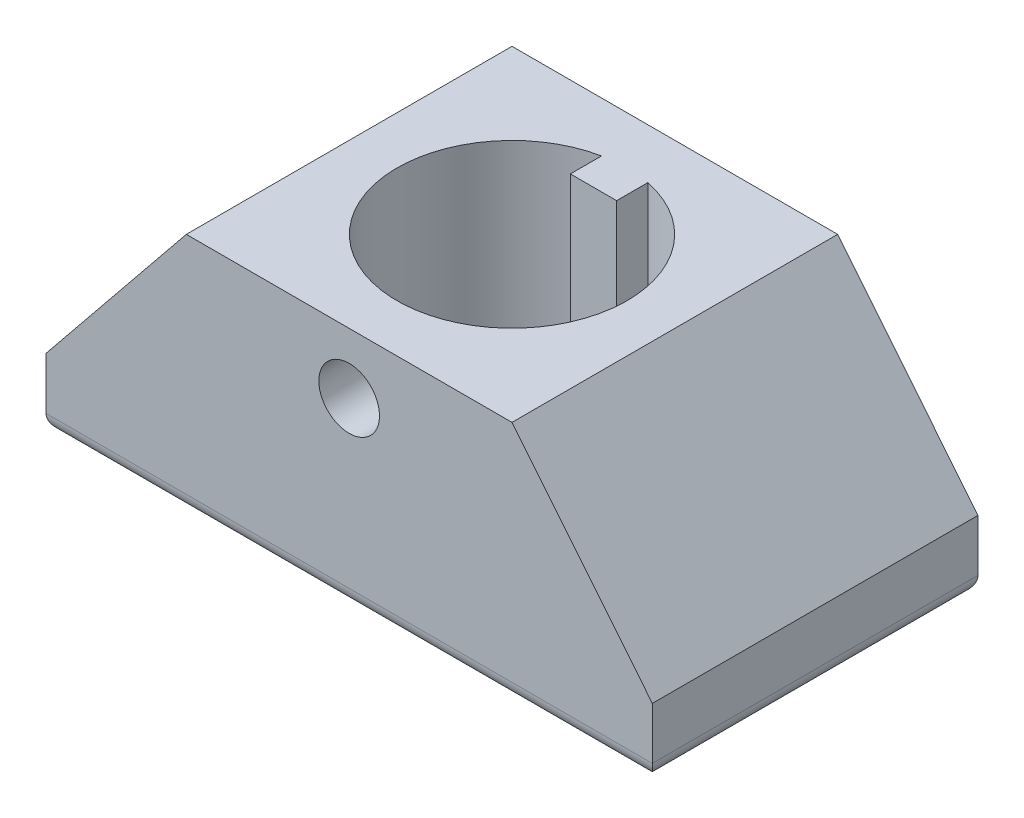
ISO-10303-21;
HEADER;
FILE_DESCRIPTION(('STEP AP214'),'2;1');
FILE_NAME('part.step','',(''),(''),'','','');
FILE_SCHEMA(('AUTOMOTIVE_DESIGN { 1 0 10303 214 1 1 1 1 }'));
ENDSEC;
DATA;
#1=APPLICATION_CONTEXT('core data for automotive mechanical design processes');
#2=APPLICATION_PROTOCOL_DEFINITION('international standard','automotive_design',2000,#1);
#3=PRODUCT_CONTEXT('',#1,'mechanical');
#4=PRODUCT('Part','Part','',(#3));
#5=PRODUCT_RELATED_PRODUCT_CATEGORY('part','',(#4));
#6=PRODUCT_DEFINITION_FORMATION('','',#4);
#7=PRODUCT_DEFINITION_CONTEXT('part definition',#1,'design');
#8=PRODUCT_DEFINITION('design','',#6,#7);
#9=PRODUCT_DEFINITION_SHAPE('','',#8);
#10=(LENGTH_UNIT() NAMED_UNIT(*) SI_UNIT(.MILLI.,.METRE.));
#11=(NAMED_UNIT(*) PLANE_ANGLE_UNIT() SI_UNIT($,.RADIAN.));
#12=(NAMED_UNIT(*) SI_UNIT($,.STERADIAN.) SOLID_ANGLE_UNIT());
#13=UNCERTAINTY_MEASURE_WITH_UNIT(LENGTH_MEASURE(1.E-05),#10,'distance_accuracy_value','');
#14=(GEOMETRIC_REPRESENTATION_CONTEXT(3) GLOBAL_UNCERTAINTY_ASSIGNED_CONTEXT((#13)) GLOBAL_UNIT_ASSIGNED_CONTEXT((#10,
#11,#12)) REPRESENTATION_CONTEXT('',''));
#15=CARTESIAN_POINT('',(0.,0.,0.));
#16=DIRECTION('',(0.,0.,1.));
#17=DIRECTION('',(1.,0.,0.));
#18=AXIS2_PLACEMENT_3D('',#15,#16,#17);
#19=CARTESIAN_POINT('',(-9.4,10.,9.4));
#20=DIRECTION('',(0.,0.,-1.));
#21=DIRECTION('',(-1.,0.,0.));
#22=AXIS2_PLACEMENT_3D('',#19,#20,#21);
#23=PLANE('',#22);
#24=DIRECTION('',(0.,1.,0.));
#25=VECTOR('',#24,1.);
#26=CARTESIAN_POINT('',(-17.5,-4.,9.4));
#27=LINE('',#26,#25);
#28=CARTESIAN_POINT('',(-17.5,-3.,9.4));
#29=VERTEX_POINT('',#28);
#30=CARTESIAN_POINT('',(-17.5,0.,9.4));
#31=VERTEX_POINT('',#30);
#32=EDGE_CURVE('E286',#29,#31,#27,.T.);
#33=ORIENTED_EDGE('',*,*,#32,.F.);
#34=DIRECTION('',(-1.,0.,0.));
#35=VECTOR('',#34,1.);
#36=CARTESIAN_POINT('',(17.5,-3.,9.4));
#37=LINE('',#36,#35);
#38=CARTESIAN_POINT('',(17.5,-3.,9.4));
#39=VERTEX_POINT('',#38);
#40=EDGE_CURVE('E186',#29,#39,#37,.F.);
#41=ORIENTED_EDGE('',*,*,#40,.T.);
#42=DIRECTION('',(0.,1.,0.));
#43=VECTOR('',#42,1.);
#44=CARTESIAN_POINT('',(17.5,-4.,9.4));
#45=LINE('',#44,#43);
#46=CARTESIAN_POINT('',(17.5,0.,9.4));
#47=VERTEX_POINT('',#46);
#48=EDGE_CURVE('E158',#39,#47,#45,.T.);
#49=ORIENTED_EDGE('',*,*,#48,.T.);
#50=DIRECTION('',(-0.629421741569467,0.777063878480823,0.));
#51=VECTOR('',#50,1.);
#52=CARTESIAN_POINT('',(17.5,0.,9.4));
#53=LINE('',#52,#51);
#54=CARTESIAN_POINT('',(9.4,10.,9.4));
#55=VERTEX_POINT('',#54);
#56=EDGE_CURVE('E140',#47,#55,#53,.T.);
#57=ORIENTED_EDGE('',*,*,#56,.T.);
#58=DIRECTION('',(1.,0.,0.));
#59=VECTOR('',#58,1.);
#60=CARTESIAN_POINT('',(-9.4,10.,9.4));
#61=LINE('',#60,#59);
#62=CARTESIAN_POINT('',(-9.4,10.,9.4));
#63=VERTEX_POINT('',#62);
#64=EDGE_CURVE('E156',#63,#55,#61,.T.);
#65=ORIENTED_EDGE('',*,*,#64,.F.);
#66=DIRECTION('',(-0.629421741569467,-0.777063878480823,0.));
#67=VECTOR('',#66,1.);
#68=CARTESIAN_POINT('',(-17.5,0.,9.4));
#69=LINE('',#68,#67);
#70=EDGE_CURVE('E277',#63,#31,#69,.T.);
#71=ORIENTED_EDGE('',*,*,#70,.T.);
#72=EDGE_LOOP('',(#33,#41,#49,#57,#65,#71));
#73=FACE_BOUND('',#72,.T.);
#74=CARTESIAN_POINT('',(-0.000110737257354362,6.5,9.4));
#75=DIRECTION('',(0.,0.,-1.));
#76=DIRECTION('',(-1.,0.,0.));
#77=AXIS2_PLACEMENT_3D('',#74,#75,#76);
#78=CIRCLE('',#77,1.75);
#79=CARTESIAN_POINT('',(-1.75011073725735,6.5,9.4));
#80=VERTEX_POINT('',#79);
#81=EDGE_CURVE('E299',#80,#80,#78,.F.);
#82=ORIENTED_EDGE('',*,*,#81,.F.);
#83=EDGE_LOOP('',(#82));
#84=FACE_BOUND('',#83,.T.);
#85=ADVANCED_FACE('F32',(#73,#84),#23,.F.);
#86=CARTESIAN_POINT('',(0.,10.,0.));
#87=DIRECTION('',(0.,-1.,0.));
#88=DIRECTION('',(0.,0.,-1.));
#89=AXIS2_PLACEMENT_3D('',#86,#87,#88);
#90=CYLINDRICAL_SURFACE('',#89,6.64);
#91=DIRECTION('',(0.,-1.,0.));
#92=VECTOR('',#91,1.);
#93=CARTESIAN_POINT('',(1.335,10.,-6.50441196419784));
#94=LINE('',#93,#92);
#95=CARTESIAN_POINT('',(1.335,10.,-6.50441196419784));
#96=VERTEX_POINT('',#95);
#97=CARTESIAN_POINT('',(1.335,-3.5,-6.50441196419784));
#98=VERTEX_POINT('',#97);
#99=EDGE_CURVE('E149',#96,#98,#94,.T.);
#100=ORIENTED_EDGE('',*,*,#99,.T.);
#101=CARTESIAN_POINT('',(0.,-3.5,0.));
#102=DIRECTION('',(0.,-1.,0.));
#103=DIRECTION('',(0.,0.,-1.));
#104=AXIS2_PLACEMENT_3D('',#101,#102,#103);
#105=CIRCLE('',#104,6.64);
#106=CARTESIAN_POINT('',(-1.335,-3.5,-6.50441196419784));
#107=VERTEX_POINT('',#106);
#108=EDGE_CURVE('E11',#98,#107,#105,.T.);
#109=ORIENTED_EDGE('',*,*,#108,.T.);
#110=DIRECTION('',(0.,-1.,0.));
#111=VECTOR('',#110,1.);
#112=CARTESIAN_POINT('',(-1.335,10.,-6.50441196419784));
#113=LINE('',#112,#111);
#114=CARTESIAN_POINT('',(-1.335,10.,-6.50441196419784));
#115=VERTEX_POINT('',#114);
#116=EDGE_CURVE('E254',#115,#107,#113,.T.);
#117=ORIENTED_EDGE('',*,*,#116,.F.);
#118=CARTESIAN_POINT('',(0.,10.,0.));
#119=DIRECTION('',(0.,1.,0.));
#120=DIRECTION('',(0.,0.,1.));
#121=AXIS2_PLACEMENT_3D('',#118,#119,#120);
#122=CIRCLE('',#121,6.64);
#123=EDGE_CURVE('E526',#115,#96,#122,.T.);
#124=ORIENTED_EDGE('',*,*,#123,.T.);
#125=EDGE_LOOP('',(#100,#109,#117,#124));
#126=FACE_BOUND('',#125,.T.);
#127=CARTESIAN_POINT('',(-1.75011073725735,6.5,6.40520978636426));
#128=CARTESIAN_POINT('',(-1.75010832759222,6.40355190458059,6.40521149686969));
#129=CARTESIAN_POINT('',(-1.74211022906524,6.30707809141423,6.4074121723757));
#130=CARTESIAN_POINT('',(-1.71038795404314,6.11691363059734,6.41595151607451));
#131=CARTESIAN_POINT('',(-1.68665564832349,6.02322444780954,6.42229232327917));
#132=CARTESIAN_POINT('',(-1.62429681853546,5.84140763282842,6.43834505541008));
#133=CARTESIAN_POINT('',(-1.58569090909135,5.75327249865549,6.44805231262846));
#134=CARTESIAN_POINT('',(-1.49474500676041,5.58471697312093,6.46973830994011));
#135=CARTESIAN_POINT('',(-1.44240403802284,5.50429713047122,6.48171721141275));
#136=CARTESIAN_POINT('',(-1.32410626115722,5.35148959770937,6.50692483052401));
#137=CARTESIAN_POINT('',(-1.25787443530343,5.27931835940103,6.52017529754237));
#138=CARTESIAN_POINT('',(-1.11426667289116,5.14696890378987,6.5462452743948));
#139=CARTESIAN_POINT('',(-1.03688960440083,5.08679190612632,6.55906474029228));
#140=CARTESIAN_POINT('',(-0.871690168021992,4.9792396467425,6.58307072466007));
#141=CARTESIAN_POINT('',(-0.78372347636224,4.93207911633263,6.59422859683805));
#142=CARTESIAN_POINT('',(-0.600766827622744,4.85329807388153,6.61340505210647));
#143=CARTESIAN_POINT('',(-0.505778029222144,4.82167500464464,6.62142415174001));
#144=CARTESIAN_POINT('',(-0.31373200741287,4.77556563554015,6.63326589286851));
#145=CARTESIAN_POINT('',(-0.216768792080674,4.76071130498466,6.63717851972146));
#146=CARTESIAN_POINT('',(-0.0216529574121044,4.74740372696739,6.64068106198441));
#147=CARTESIAN_POINT('',(0.0764994646446977,4.74894779537203,6.64027168483159));
#148=CARTESIAN_POINT('',(0.26864722377245,4.76813295887809,6.63524258429587));
#149=CARTESIAN_POINT('',(0.362685398090793,4.78537643619284,6.63072686536309));
#150=CARTESIAN_POINT('',(0.546483161860189,4.83482922606549,6.61811506633964));
#151=CARTESIAN_POINT('',(0.636242510011772,4.86703938155368,6.61001878459123));
#152=CARTESIAN_POINT('',(0.809955428296482,4.94581898804884,6.59100058485584));
#153=CARTESIAN_POINT('',(0.893843735531379,4.9925256051571,6.58005184286494));
#154=CARTESIAN_POINT('',(1.05272819660212,5.09886726543101,6.55651002537682));
#155=CARTESIAN_POINT('',(1.12772264810152,5.15850477748772,6.54391663605056));
#156=CARTESIAN_POINT('',(1.26906312163256,5.29112968278022,6.51800599905694));
#157=CARTESIAN_POINT('',(1.33508213876145,5.36446394105981,6.50467836982763));
#158=CARTESIAN_POINT('',(1.45396343595696,5.52130113157522,6.47914328581523));
#159=CARTESIAN_POINT('',(1.50682495165159,5.60480465416487,6.46693589613735));
#160=CARTESIAN_POINT('',(1.59813211784441,5.78030633594551,6.44498269857443));
#161=CARTESIAN_POINT('',(1.63649080803175,5.8723517399845,6.43525185049922));
#162=CARTESIAN_POINT('',(1.69708306801695,6.0619050624208,6.41954045581025));
#163=CARTESIAN_POINT('',(1.71932052969073,6.15941165628799,6.41355900409027));
#164=CARTESIAN_POINT('',(1.74647947585441,6.35406648338945,6.40621597059032));
#165=CARTESIAN_POINT('',(1.75188788470853,6.45114195662779,6.40472451974359));
#166=CARTESIAN_POINT('',(1.74657514374982,6.64480984927769,6.40617538961841));
#167=CARTESIAN_POINT('',(1.73585566526846,6.74140231770227,6.40911725091628));
#168=CARTESIAN_POINT('',(1.69902028381144,6.92949917354345,6.41897799576124));
#169=CARTESIAN_POINT('',(1.67319533443229,7.02106486432568,6.42582166343382));
#170=CARTESIAN_POINT('',(1.6072083557109,7.19856562471033,6.44264178948863));
#171=CARTESIAN_POINT('',(1.56704448661028,7.28449997010637,6.45261864985608));
#172=CARTESIAN_POINT('',(1.47252535018927,7.45034092790113,6.47484884761302));
#173=CARTESIAN_POINT('',(1.41788314052692,7.53007791418768,6.48714657570566));
#174=CARTESIAN_POINT('',(1.29631544278067,7.67942966689376,6.51252749902118));
#175=CARTESIAN_POINT('',(1.22938770154786,7.74904257236724,6.52561083802732));
#176=CARTESIAN_POINT('',(1.08289985470133,7.87818204305388,6.55153448939438));
#177=CARTESIAN_POINT('',(1.0030372127568,7.93736956184584,6.56435759630264));
#178=CARTESIAN_POINT('',(0.834226629471697,8.04149728831692,6.58793732044516));
#179=CARTESIAN_POINT('',(0.745279171529372,8.08643825352597,6.59869404754275));
#180=CARTESIAN_POINT('',(0.561449324103487,8.16038825491931,6.61685971529549));
#181=CARTESIAN_POINT('',(0.466617106492553,8.18951562893133,6.62429344669557));
#182=CARTESIAN_POINT('',(0.273179465022905,8.23135754814256,6.6350844059323));
#183=CARTESIAN_POINT('',(0.17457486119842,8.24407563972162,6.63844251458464));
#184=CARTESIAN_POINT('',(-0.0204374258438768,8.25252013345003,6.6406632597644));
#185=CARTESIAN_POINT('',(-0.116822355931245,8.24874447590174,6.63965764181972));
#186=CARTESIAN_POINT('',(-0.307533931602299,8.22546185942616,6.63356057161639));
#187=CARTESIAN_POINT('',(-0.401860651121968,8.20595546654421,6.62846926637468));
#188=CARTESIAN_POINT('',(-0.585194414411886,8.1520439118479,6.61479779853064));
#189=CARTESIAN_POINT('',(-0.674232381154391,8.11773764154536,6.60624081610811));
#190=CARTESIAN_POINT('',(-0.845339247303668,8.03528870002273,6.58653379995653));
#191=CARTESIAN_POINT('',(-0.927407185038062,7.98714412350154,6.57538340919931));
#192=CARTESIAN_POINT('',(-1.08457129122108,7.87691591582682,6.55132018215601));
#193=CARTESIAN_POINT('',(-1.15942892183913,7.81450059310827,6.53836887169459));
#194=CARTESIAN_POINT('',(-1.29777647163385,7.67813456334133,6.51232236134215));
#195=CARTESIAN_POINT('',(-1.36126341648905,7.60418084754107,6.49922712475119));
#196=CARTESIAN_POINT('',(-1.47640667623835,7.44493838117469,6.47405427830082));
#197=CARTESIAN_POINT('',(-1.52778161901743,7.35944142209047,6.46200434754477));
#198=CARTESIAN_POINT('',(-1.61535455307748,7.18071675795486,6.44067347651319));
#199=CARTESIAN_POINT('',(-1.65156268894718,7.08749427041209,6.43139068658844));
#200=CARTESIAN_POINT('',(-1.70290853359401,6.91214979309664,6.41796527429947));
#201=CARTESIAN_POINT('',(-1.72056838153899,6.83080371361552,6.41322013776544));
#202=CARTESIAN_POINT('',(-1.74416988911726,6.6663113330149,6.40684182447562));
#203=CARTESIAN_POINT('',(-1.7501128150625,6.58316522741613,6.40520831143028));
#204=CARTESIAN_POINT('',(-1.75011073725735,6.5,6.40520978636426));
#205=B_SPLINE_CURVE_WITH_KNOTS('',3,(#127,#128,#129,#130,#131,#132,#133,#134,#135,#136,#137,
#138,#139,#140,#141,#142,#143,#144,#145,#146,#147,#148,#149,#150,#151,#152,#153,#154,#155,#156,
#157,#158,#159,#160,#161,#162,#163,#164,#165,#166,#167,#168,#169,#170,#171,#172,#173,#174,#175,
#176,#177,#178,#179,#180,#181,#182,#183,#184,#185,#186,#187,#188,#189,#190,#191,#192,#193,#194,
#195,#196,#197,#198,#199,#200,#201,#202,#203,#204),.UNSPECIFIED.,.T.,.F.,(4,2,2,2,2,2,2,2,2,2,2,
2,2,2,2,2,2,2,2,2,2,2,2,2,2,2,2,2,2,2,2,2,2,2,2,2,2,2,4),(0.,0.289038552489628,
0.578226555933059,0.867015182094852,1.15582433171573,1.45100777122896,1.74622121129482,
2.04604761342906,2.34582465281315,2.63888603346523,2.93189944579002,3.21769210903103,
3.50350087019944,3.7921009491594,4.08075617902517,4.37807231741418,4.67540572406019,
4.97449471440354,5.27351147667722,5.56379212586019,5.85404269535802,6.13887858862289,
6.42375104096404,6.71475723460522,7.00581685178505,7.30506882272272,7.60430487890856,
7.90126966572967,8.19817026166111,8.48617050073422,8.774160377042,9.06025503187545,
9.34638909599611,9.64000826249492,9.93370412149794,10.2336673450236,10.5334296111891,
10.7826886057007,11.0319206599501),.UNSPECIFIED.);
#206=CARTESIAN_POINT('',(-1.75011073725735,6.5,6.40520978636426));
#207=VERTEX_POINT('',#206);
#208=EDGE_CURVE('E292',#207,#207,#205,.T.);
#209=ORIENTED_EDGE('',*,*,#208,.T.);
#210=EDGE_LOOP('',(#209));
#211=FACE_BOUND('',#210,.T.);
#212=ADVANCED_FACE('F301',(#126,#211),#90,.F.);
#213=CARTESIAN_POINT('',(0.,10.,0.));
#214=DIRECTION('',(0.,-1.,0.));
#215=DIRECTION('',(0.,0.,-1.));
#216=AXIS2_PLACEMENT_3D('',#213,#214,#215);
#217=PLANE('',#216);
#218=DIRECTION('',(0.,0.,-1.));
#219=VECTOR('',#218,1.);
#220=CARTESIAN_POINT('',(9.4,10.,9.4));
#221=LINE('',#220,#219);
#222=CARTESIAN_POINT('',(9.4,10.,-9.4));
#223=VERTEX_POINT('',#222);
#224=EDGE_CURVE('E136',#55,#223,#221,.T.);
#225=ORIENTED_EDGE('',*,*,#224,.T.);
#226=DIRECTION('',(-1.,0.,0.));
#227=VECTOR('',#226,1.);
#228=CARTESIAN_POINT('',(-9.4,10.,-9.4));
#229=LINE('',#228,#227);
#230=CARTESIAN_POINT('',(-9.4,10.,-9.4));
#231=VERTEX_POINT('',#230);
#232=EDGE_CURVE('E148',#223,#231,#229,.T.);
#233=ORIENTED_EDGE('',*,*,#232,.T.);
#234=DIRECTION('',(0.,0.,1.));
#235=VECTOR('',#234,1.);
#236=CARTESIAN_POINT('',(-9.4,10.,9.4));
#237=LINE('',#236,#235);
#238=EDGE_CURVE('E165',#231,#63,#237,.T.);
#239=ORIENTED_EDGE('',*,*,#238,.T.);
#240=ORIENTED_EDGE('',*,*,#64,.T.);
#241=EDGE_LOOP('',(#225,#233,#239,#240));
#242=FACE_BOUND('',#241,.T.);
#243=ORIENTED_EDGE('',*,*,#123,.F.);
#244=DIRECTION('',(0.,0.,-1.));
#245=VECTOR('',#244,1.);
#246=CARTESIAN_POINT('',(-1.335,10.,-6.50441196419784));
#247=LINE('',#246,#245);
#248=CARTESIAN_POINT('',(-1.335,10.,-4.70441196419784));
#249=VERTEX_POINT('',#248);
#250=EDGE_CURVE('E262',#249,#115,#247,.T.);
#251=ORIENTED_EDGE('',*,*,#250,.F.);
#252=DIRECTION('',(-1.,0.,0.));
#253=VECTOR('',#252,1.);
#254=CARTESIAN_POINT('',(-1.335,10.,-4.70441196419784));
#255=LINE('',#254,#253);
#256=CARTESIAN_POINT('',(1.335,10.,-4.70441196419784));
#257=VERTEX_POINT('',#256);
#258=EDGE_CURVE('E257',#257,#249,#255,.T.);
#259=ORIENTED_EDGE('',*,*,#258,.F.);
#260=DIRECTION('',(0.,0.,1.));
#261=VECTOR('',#260,1.);
#262=CARTESIAN_POINT('',(1.335,10.,-4.70441196419784));
#263=LINE('',#262,#261);
#264=EDGE_CURVE('E528',#96,#257,#263,.T.);
#265=ORIENTED_EDGE('',*,*,#264,.F.);
#266=EDGE_LOOP('',(#243,#251,#259,#265));
#267=FACE_BOUND('',#266,.T.);
#268=ADVANCED_FACE('F162',(#242,#267),#217,.F.);
#269=CARTESIAN_POINT('',(-9.4,10.,-9.4));
#270=DIRECTION('',(0.,0.,1.));
#271=DIRECTION('',(1.,0.,0.));
#272=AXIS2_PLACEMENT_3D('',#269,#270,#271);
#273=PLANE('',#272);
#274=DIRECTION('',(0.,1.,0.));
#275=VECTOR('',#274,1.);
#276=CARTESIAN_POINT('',(17.5,-4.,-9.4));
#277=LINE('',#276,#275);
#278=CARTESIAN_POINT('',(17.5,-3.,-9.4));
#279=VERTEX_POINT('',#278);
#280=CARTESIAN_POINT('',(17.5,0.,-9.4));
#281=VERTEX_POINT('',#280);
#282=EDGE_CURVE('E289',#279,#281,#277,.T.);
#283=ORIENTED_EDGE('',*,*,#282,.F.);
#284=DIRECTION('',(1.,0.,0.));
#285=VECTOR('',#284,1.);
#286=CARTESIAN_POINT('',(-17.5,-3.,-9.4));
#287=LINE('',#286,#285);
#288=CARTESIAN_POINT('',(-17.5,-3.,-9.4));
#289=VERTEX_POINT('',#288);
#290=EDGE_CURVE('E182',#279,#289,#287,.F.);
#291=ORIENTED_EDGE('',*,*,#290,.T.);
#292=DIRECTION('',(0.,1.,0.));
#293=VECTOR('',#292,1.);
#294=CARTESIAN_POINT('',(-17.5,-4.,-9.4));
#295=LINE('',#294,#293);
#296=CARTESIAN_POINT('',(-17.5,0.,-9.4));
#297=VERTEX_POINT('',#296);
#298=EDGE_CURVE('E272',#289,#297,#295,.T.);
#299=ORIENTED_EDGE('',*,*,#298,.T.);
#300=DIRECTION('',(0.629421741569467,0.777063878480823,0.));
#301=VECTOR('',#300,1.);
#302=CARTESIAN_POINT('',(-17.5,0.,-9.4));
#303=LINE('',#302,#301);
#304=EDGE_CURVE('E270',#297,#231,#303,.T.);
#305=ORIENTED_EDGE('',*,*,#304,.T.);
#306=ORIENTED_EDGE('',*,*,#232,.F.);
#307=DIRECTION('',(0.629421741569467,-0.777063878480823,0.));
#308=VECTOR('',#307,1.);
#309=CARTESIAN_POINT('',(17.5,0.,-9.4));
#310=LINE('',#309,#308);
#311=EDGE_CURVE('E143',#223,#281,#310,.T.);
#312=ORIENTED_EDGE('',*,*,#311,.T.);
#313=EDGE_LOOP('',(#283,#291,#299,#305,#306,#312));
#314=FACE_BOUND('',#313,.T.);
#315=ADVANCED_FACE('F268',(#314),#273,.F.);
#316=CARTESIAN_POINT('',(1.335,10.,-4.70441196419784));
#317=DIRECTION('',(1.,0.,0.));
#318=DIRECTION('',(0.,0.,-1.));
#319=AXIS2_PLACEMENT_3D('',#316,#317,#318);
#320=PLANE('',#319);
#321=DIRECTION('',(0.,-1.,0.));
#322=VECTOR('',#321,1.);
#323=CARTESIAN_POINT('',(1.335,10.,-4.70441196419784));
#324=LINE('',#323,#322);
#325=CARTESIAN_POINT('',(1.335,-3.5,-4.70441196419784));
#326=VERTEX_POINT('',#325);
#327=EDGE_CURVE('E259',#257,#326,#324,.T.);
#328=ORIENTED_EDGE('',*,*,#327,.T.);
#329=DIRECTION('',(0.,0.,1.));
#330=VECTOR('',#329,1.);
#331=CARTESIAN_POINT('',(1.335,-3.5,-4.70441196419784));
#332=LINE('',#331,#330);
#333=EDGE_CURVE('E41',#326,#98,#332,.F.);
#334=ORIENTED_EDGE('',*,*,#333,.T.);
#335=ORIENTED_EDGE('',*,*,#99,.F.);
#336=ORIENTED_EDGE('',*,*,#264,.T.);
#337=EDGE_LOOP('',(#328,#334,#335,#336));
#338=FACE_BOUND('',#337,.T.);
#339=ADVANCED_FACE('F316',(#338),#320,.T.);
#340=CARTESIAN_POINT('',(-1.335,10.,-4.70441196419784));
#341=DIRECTION('',(0.,0.,1.));
#342=DIRECTION('',(1.,0.,0.));
#343=AXIS2_PLACEMENT_3D('',#340,#341,#342);
#344=PLANE('',#343);
#345=DIRECTION('',(0.,-1.,0.));
#346=VECTOR('',#345,1.);
#347=CARTESIAN_POINT('',(-1.335,10.,-4.70441196419784));
#348=LINE('',#347,#346);
#349=CARTESIAN_POINT('',(-1.335,-3.5,-4.70441196419784));
#350=VERTEX_POINT('',#349);
#351=EDGE_CURVE('E251',#249,#350,#348,.T.);
#352=ORIENTED_EDGE('',*,*,#351,.T.);
#353=DIRECTION('',(-1.,0.,0.));
#354=VECTOR('',#353,1.);
#355=CARTESIAN_POINT('',(-1.335,-3.5,-4.70441196419784));
#356=LINE('',#355,#354);
#357=EDGE_CURVE('E56',#350,#326,#356,.F.);
#358=ORIENTED_EDGE('',*,*,#357,.T.);
#359=ORIENTED_EDGE('',*,*,#327,.F.);
#360=ORIENTED_EDGE('',*,*,#258,.T.);
#361=EDGE_LOOP('',(#352,#358,#359,#360));
#362=FACE_BOUND('',#361,.T.);
#363=ADVANCED_FACE('F255',(#362),#344,.T.);
#364=CARTESIAN_POINT('',(-1.335,10.,-6.50441196419784));
#365=DIRECTION('',(-1.,0.,0.));
#366=DIRECTION('',(0.,0.,1.));
#367=AXIS2_PLACEMENT_3D('',#364,#365,#366);
#368=PLANE('',#367);
#369=ORIENTED_EDGE('',*,*,#116,.T.);
#370=DIRECTION('',(0.,0.,-1.));
#371=VECTOR('',#370,1.);
#372=CARTESIAN_POINT('',(-1.335,-3.5,-6.50441196419784));
#373=LINE('',#372,#371);
#374=EDGE_CURVE('E206',#107,#350,#373,.F.);
#375=ORIENTED_EDGE('',*,*,#374,.T.);
#376=ORIENTED_EDGE('',*,*,#351,.F.);
#377=ORIENTED_EDGE('',*,*,#250,.T.);
#378=EDGE_LOOP('',(#369,#375,#376,#377));
#379=FACE_BOUND('',#378,.T.);
#380=ADVANCED_FACE('F250',(#379),#368,.T.);
#381=CARTESIAN_POINT('',(-0.000110737257354362,6.5,10.2955880358022));
#382=DIRECTION('',(0.,0.,-1.));
#383=DIRECTION('',(-1.,0.,0.));
#384=AXIS2_PLACEMENT_3D('',#381,#382,#383);
#385=CYLINDRICAL_SURFACE('',#384,1.75);
#386=ORIENTED_EDGE('',*,*,#208,.F.);
#387=EDGE_LOOP('',(#386));
#388=FACE_BOUND('',#387,.T.);
#389=ORIENTED_EDGE('',*,*,#81,.T.);
#390=EDGE_LOOP('',(#389));
#391=FACE_BOUND('',#390,.T.);
#392=ADVANCED_FACE('F305',(#388,#391),#385,.F.);
#393=CARTESIAN_POINT('',(-17.5,-4.,-9.4));
#394=DIRECTION('',(1.,0.,0.));
#395=DIRECTION('',(0.,0.,-1.));
#396=AXIS2_PLACEMENT_3D('',#393,#394,#395);
#397=PLANE('',#396);
#398=ORIENTED_EDGE('',*,*,#298,.F.);
#399=DIRECTION('',(0.,0.,-1.));
#400=VECTOR('',#399,1.);
#401=CARTESIAN_POINT('',(-17.5,-3.,9.4));
#402=LINE('',#401,#400);
#403=EDGE_CURVE('E184',#289,#29,#402,.F.);
#404=ORIENTED_EDGE('',*,*,#403,.T.);
#405=ORIENTED_EDGE('',*,*,#32,.T.);
#406=DIRECTION('',(0.,0.,-1.));
#407=VECTOR('',#406,1.);
#408=CARTESIAN_POINT('',(-17.5,0.,-9.4));
#409=LINE('',#408,#407);
#410=EDGE_CURVE('E276',#31,#297,#409,.T.);
#411=ORIENTED_EDGE('',*,*,#410,.T.);
#412=EDGE_LOOP('',(#398,#404,#405,#411));
#413=FACE_BOUND('',#412,.T.);
#414=ADVANCED_FACE('F310',(#413),#397,.F.);
#415=CARTESIAN_POINT('',(17.5,-4.,-9.4));
#416=DIRECTION('',(-1.,0.,0.));
#417=DIRECTION('',(0.,0.,1.));
#418=AXIS2_PLACEMENT_3D('',#415,#416,#417);
#419=PLANE('',#418);
#420=ORIENTED_EDGE('',*,*,#48,.F.);
#421=DIRECTION('',(0.,0.,1.));
#422=VECTOR('',#421,1.);
#423=CARTESIAN_POINT('',(17.5,-3.,-9.4));
#424=LINE('',#423,#422);
#425=EDGE_CURVE('E179',#39,#279,#424,.F.);
#426=ORIENTED_EDGE('',*,*,#425,.T.);
#427=ORIENTED_EDGE('',*,*,#282,.T.);
#428=DIRECTION('',(0.,0.,1.));
#429=VECTOR('',#428,1.);
#430=CARTESIAN_POINT('',(17.5,0.,-9.4));
#431=LINE('',#430,#429);
#432=EDGE_CURVE('E284',#281,#47,#431,.T.);
#433=ORIENTED_EDGE('',*,*,#432,.T.);
#434=EDGE_LOOP('',(#420,#426,#427,#433));
#435=FACE_BOUND('',#434,.T.);
#436=ADVANCED_FACE('F355',(#435),#419,.F.);
#437=CARTESIAN_POINT('',(0.,-4.,0.));
#438=DIRECTION('',(0.,-1.,0.));
#439=DIRECTION('',(0.,0.,-1.));
#440=AXIS2_PLACEMENT_3D('',#437,#438,#439);
#441=PLANE('',#440);
#442=DIRECTION('',(-1.,0.,0.));
#443=VECTOR('',#442,1.);
#444=CARTESIAN_POINT('',(0.,-4.,-5.20441196419784));
#445=LINE('',#444,#443);
#446=CARTESIAN_POINT('',(0.835,-4.,-5.20441196419784));
#447=VERTEX_POINT('',#446);
#448=CARTESIAN_POINT('',(-0.835,-4.,-5.20441196419784));
#449=VERTEX_POINT('',#448);
#450=EDGE_CURVE('E201',#447,#449,#445,.T.);
#451=ORIENTED_EDGE('',*,*,#450,.T.);
#452=DIRECTION('',(0.,0.,-1.));
#453=VECTOR('',#452,1.);
#454=CARTESIAN_POINT('',(-0.835,-4.,0.));
#455=LINE('',#454,#453);
#456=CARTESIAN_POINT('',(-0.835,-4.,-7.09100662811706));
#457=VERTEX_POINT('',#456);
#458=EDGE_CURVE('E203',#449,#457,#455,.T.);
#459=ORIENTED_EDGE('',*,*,#458,.T.);
#460=CARTESIAN_POINT('',(0.,-4.,0.));
#461=DIRECTION('',(0.,-1.,0.));
#462=DIRECTION('',(0.,0.,-1.));
#463=AXIS2_PLACEMENT_3D('',#460,#461,#462);
#464=CIRCLE('',#463,7.14);
#465=CARTESIAN_POINT('',(0.835,-4.,-7.09100662811706));
#466=VERTEX_POINT('',#465);
#467=EDGE_CURVE('E188',#457,#466,#464,.F.);
#468=ORIENTED_EDGE('',*,*,#467,.T.);
#469=DIRECTION('',(0.,0.,1.));
#470=VECTOR('',#469,1.);
#471=CARTESIAN_POINT('',(0.835,-4.,0.));
#472=LINE('',#471,#470);
#473=EDGE_CURVE('E199',#466,#447,#472,.T.);
#474=ORIENTED_EDGE('',*,*,#473,.T.);
#475=EDGE_LOOP('',(#451,#459,#468,#474));
#476=FACE_BOUND('',#475,.T.);
#477=DIRECTION('',(1.,0.,0.));
#478=VECTOR('',#477,1.);
#479=CARTESIAN_POINT('',(17.5,-4.,-8.4));
#480=LINE('',#479,#478);
#481=CARTESIAN_POINT('',(-16.5,-4.,-8.4));
#482=VERTEX_POINT('',#481);
#483=CARTESIAN_POINT('',(16.5,-4.,-8.4));
#484=VERTEX_POINT('',#483);
#485=EDGE_CURVE('E174',#482,#484,#480,.T.);
#486=ORIENTED_EDGE('',*,*,#485,.T.);
#487=DIRECTION('',(0.,0.,1.));
#488=VECTOR('',#487,1.);
#489=CARTESIAN_POINT('',(16.5,-4.,9.4));
#490=LINE('',#489,#488);
#491=CARTESIAN_POINT('',(16.5,-4.,8.4));
#492=VERTEX_POINT('',#491);
#493=EDGE_CURVE('E176',#484,#492,#490,.T.);
#494=ORIENTED_EDGE('',*,*,#493,.T.);
#495=DIRECTION('',(-1.,0.,0.));
#496=VECTOR('',#495,1.);
#497=CARTESIAN_POINT('',(-17.5,-4.,8.4));
#498=LINE('',#497,#496);
#499=CARTESIAN_POINT('',(-16.5,-4.,8.4));
#500=VERTEX_POINT('',#499);
#501=EDGE_CURVE('E166',#492,#500,#498,.T.);
#502=ORIENTED_EDGE('',*,*,#501,.T.);
#503=DIRECTION('',(0.,0.,-1.));
#504=VECTOR('',#503,1.);
#505=CARTESIAN_POINT('',(-16.5,-4.,-9.4));
#506=LINE('',#505,#504);
#507=EDGE_CURVE('E168',#500,#482,#506,.T.);
#508=ORIENTED_EDGE('',*,*,#507,.T.);
#509=EDGE_LOOP('',(#486,#494,#502,#508));
#510=FACE_BOUND('',#509,.T.);
#511=ADVANCED_FACE('F365',(#476,#510),#441,.T.);
#512=CARTESIAN_POINT('',(-17.5,0.,-22.2689548915209));
#513=DIRECTION('',(-0.777063878480823,0.629421741569467,0.));
#514=DIRECTION('',(-0.629421741569467,-0.777063878480823,0.));
#515=AXIS2_PLACEMENT_3D('',#512,#513,#514);
#516=PLANE('',#515);
#517=ORIENTED_EDGE('',*,*,#304,.F.);
#518=ORIENTED_EDGE('',*,*,#410,.F.);
#519=ORIENTED_EDGE('',*,*,#70,.F.);
#520=ORIENTED_EDGE('',*,*,#238,.F.);
#521=EDGE_LOOP('',(#517,#518,#519,#520));
#522=FACE_BOUND('',#521,.T.);
#523=ADVANCED_FACE('F279',(#522),#516,.T.);
#524=CARTESIAN_POINT('',(17.5,0.,-22.2689548915209));
#525=DIRECTION('',(0.777063878480823,0.629421741569467,0.));
#526=DIRECTION('',(-0.629421741569467,0.777063878480823,0.));
#527=AXIS2_PLACEMENT_3D('',#524,#525,#526);
#528=PLANE('',#527);
#529=ORIENTED_EDGE('',*,*,#311,.F.);
#530=ORIENTED_EDGE('',*,*,#224,.F.);
#531=ORIENTED_EDGE('',*,*,#56,.F.);
#532=ORIENTED_EDGE('',*,*,#432,.F.);
#533=EDGE_LOOP('',(#529,#530,#531,#532));
#534=FACE_BOUND('',#533,.T.);
#535=ADVANCED_FACE('F138',(#534),#528,.T.);
#536=CARTESIAN_POINT('',(-16.5,-3.,0.));
#537=DIRECTION('',(0.,0.,1.));
#538=DIRECTION('',(1.,0.,0.));
#539=AXIS2_PLACEMENT_3D('',#536,#537,#538);
#540=CYLINDRICAL_SURFACE('',#539,1.);
#541=CARTESIAN_POINT('',(-16.5,-3.,8.4));
#542=DIRECTION('',(0.707106781186547,0.,0.707106781186547));
#543=DIRECTION('',(0.707106781186547,0.,-0.707106781186547));
#544=AXIS2_PLACEMENT_3D('',#541,#542,#543);
#545=ELLIPSE('',#544,1.41421356237309,1.);
#546=EDGE_CURVE('E193',#29,#500,#545,.T.);
#547=ORIENTED_EDGE('',*,*,#546,.F.);
#548=ORIENTED_EDGE('',*,*,#403,.F.);
#549=CARTESIAN_POINT('',(-16.5,-3.,-8.4));
#550=DIRECTION('',(-0.707106781186547,0.,0.707106781186547));
#551=DIRECTION('',(0.707106781186547,0.,0.707106781186547));
#552=AXIS2_PLACEMENT_3D('',#549,#550,#551);
#553=ELLIPSE('',#552,1.41421356237309,1.);
#554=EDGE_CURVE('E159',#482,#289,#553,.F.);
#555=ORIENTED_EDGE('',*,*,#554,.F.);
#556=ORIENTED_EDGE('',*,*,#507,.F.);
#557=EDGE_LOOP('',(#547,#548,#555,#556));
#558=FACE_BOUND('',#557,.T.);
#559=ADVANCED_FACE('F338',(#558),#540,.T.);
#560=CARTESIAN_POINT('',(0.,-3.,-8.4));
#561=DIRECTION('',(-1.,0.,0.));
#562=DIRECTION('',(0.,0.,1.));
#563=AXIS2_PLACEMENT_3D('',#560,#561,#562);
#564=CYLINDRICAL_SURFACE('',#563,1.);
#565=ORIENTED_EDGE('',*,*,#554,.T.);
#566=ORIENTED_EDGE('',*,*,#290,.F.);
#567=CARTESIAN_POINT('',(16.5,-3.,-8.4));
#568=DIRECTION('',(-0.707106781186547,0.,-0.707106781186547));
#569=DIRECTION('',(-0.707106781186547,0.,0.707106781186547));
#570=AXIS2_PLACEMENT_3D('',#567,#568,#569);
#571=ELLIPSE('',#570,1.41421356237309,1.);
#572=EDGE_CURVE('E191',#484,#279,#571,.F.);
#573=ORIENTED_EDGE('',*,*,#572,.F.);
#574=ORIENTED_EDGE('',*,*,#485,.F.);
#575=EDGE_LOOP('',(#565,#566,#573,#574));
#576=FACE_BOUND('',#575,.T.);
#577=ADVANCED_FACE('F335',(#576),#564,.T.);
#578=CARTESIAN_POINT('',(0.,-3.,8.4));
#579=DIRECTION('',(1.,0.,0.));
#580=DIRECTION('',(0.,0.,-1.));
#581=AXIS2_PLACEMENT_3D('',#578,#579,#580);
#582=CYLINDRICAL_SURFACE('',#581,1.);
#583=ORIENTED_EDGE('',*,*,#546,.T.);
#584=ORIENTED_EDGE('',*,*,#501,.F.);
#585=CARTESIAN_POINT('',(16.5,-3.,8.4));
#586=DIRECTION('',(0.707106781186547,0.,-0.707106781186547));
#587=DIRECTION('',(0.707106781186547,0.,0.707106781186547));
#588=AXIS2_PLACEMENT_3D('',#585,#586,#587);
#589=ELLIPSE('',#588,1.41421356237309,1.);
#590=EDGE_CURVE('E189',#39,#492,#589,.T.);
#591=ORIENTED_EDGE('',*,*,#590,.F.);
#592=ORIENTED_EDGE('',*,*,#40,.F.);
#593=EDGE_LOOP('',(#583,#584,#591,#592));
#594=FACE_BOUND('',#593,.T.);
#595=ADVANCED_FACE('F331',(#594),#582,.T.);
#596=CARTESIAN_POINT('',(16.5,-3.,0.));
#597=DIRECTION('',(0.,0.,-1.));
#598=DIRECTION('',(-1.,0.,0.));
#599=AXIS2_PLACEMENT_3D('',#596,#597,#598);
#600=CYLINDRICAL_SURFACE('',#599,1.);
#601=ORIENTED_EDGE('',*,*,#572,.T.);
#602=ORIENTED_EDGE('',*,*,#425,.F.);
#603=ORIENTED_EDGE('',*,*,#590,.T.);
#604=ORIENTED_EDGE('',*,*,#493,.F.);
#605=EDGE_LOOP('',(#601,#602,#603,#604));
#606=FACE_BOUND('',#605,.T.);
#607=ADVANCED_FACE('F229',(#606),#600,.T.);
#608=CARTESIAN_POINT('',(0.835,-3.5,0.));
#609=DIRECTION('',(0.,0.,1.));
#610=DIRECTION('',(1.,0.,0.));
#611=AXIS2_PLACEMENT_3D('',#608,#609,#610);
#612=CYLINDRICAL_SURFACE('',#611,0.5);
#613=CARTESIAN_POINT('',(1.335,-3.5,-6.50441196419784));
#614=CARTESIAN_POINT('',(1.3350390104433,-3.5212256890873,-6.50436214812566));
#615=CARTESIAN_POINT('',(1.33365116250125,-3.54237338529058,-6.50606586997181));
#616=CARTESIAN_POINT('',(1.3283776066141,-3.58363940938797,-6.51252783974816));
#617=CARTESIAN_POINT('',(1.32452029814043,-3.60376666801826,-6.51725135834005));
#618=CARTESIAN_POINT('',(1.31467013262999,-3.64254589892404,-6.52929321410601));
#619=CARTESIAN_POINT('',(1.30868621268588,-3.66120365190492,-6.53660069154815));
#620=CARTESIAN_POINT('',(1.29498575437063,-3.69692573993988,-6.55329481110392));
#621=CARTESIAN_POINT('',(1.28726398799454,-3.71398504232672,-6.56268772571332));
#622=CARTESIAN_POINT('',(1.26608979387123,-3.75481883274049,-6.58837841070028));
#623=CARTESIAN_POINT('',(1.25174629148756,-3.77746805275804,-6.60572573683859));
#624=CARTESIAN_POINT('',(1.22090956024263,-3.81897439585307,-6.64285072857966));
#625=CARTESIAN_POINT('',(1.20441163444033,-3.83782299773537,-6.66263369867021));
#626=CARTESIAN_POINT('',(1.16107824419565,-3.88082150667761,-6.71434201291019));
#627=CARTESIAN_POINT('',(1.13327372725974,-3.90274690854883,-6.74729958389709));
#628=CARTESIAN_POINT('',(1.07557121577472,-3.93965805757858,-6.81516134102646));
#629=CARTESIAN_POINT('',(1.04567022626676,-3.95463363393717,-6.85006829690541));
#630=CARTESIAN_POINT('',(0.986407212978914,-3.97751654395575,-6.91870921101608));
#631=CARTESIAN_POINT('',(0.957120940249672,-3.98579482871761,-6.95238744338681));
#632=CARTESIAN_POINT('',(0.897915600621092,-3.99693681644455,-7.01997221260294));
#633=CARTESIAN_POINT('',(0.867998058521053,-3.99981232718181,-7.05387808866803));
#634=CARTESIAN_POINT('',(0.836987755937483,-3.99999702949171,-7.08877080799438));
#635=CARTESIAN_POINT('',(0.835993927738724,-3.99999999266758,-7.08988879511266));
#636=CARTESIAN_POINT('',(0.835,-4.,-7.09100662811706));
#637=B_SPLINE_CURVE_WITH_KNOTS('',3,(#613,#614,#615,#616,#617,#618,#619,#620,#621,#622,#623,
#624,#625,#626,#627,#628,#629,#630,#631,#632,#633,#634,#635,#636),.UNSPECIFIED.,.F.,.F.,(4,2,2,
2,2,2,2,2,2,2,2,4),(0.,0.0634400362613162,0.126163289430309,0.188626005735228,0.251279203279725,
0.346536647276597,0.442005345384991,0.58633850323001,0.730882226079211,0.866732240211926,
1.00228500698108,1.00677257468441),.UNSPECIFIED.);
#638=EDGE_CURVE('E231',#98,#466,#637,.T.);
#639=ORIENTED_EDGE('',*,*,#638,.F.);
#640=ORIENTED_EDGE('',*,*,#333,.F.);
#641=CARTESIAN_POINT('',(0.835,-3.5,-5.20441196419784));
#642=DIRECTION('',(-0.707106781186547,0.,0.707106781186547));
#643=DIRECTION('',(0.707106781186547,0.,0.707106781186547));
#644=AXIS2_PLACEMENT_3D('',#641,#642,#643);
#645=ELLIPSE('',#644,0.707106781186547,0.5);
#646=EDGE_CURVE('E36',#447,#326,#645,.T.);
#647=ORIENTED_EDGE('',*,*,#646,.F.);
#648=ORIENTED_EDGE('',*,*,#473,.F.);
#649=EDGE_LOOP('',(#639,#640,#647,#648));
#650=FACE_BOUND('',#649,.T.);
#651=ADVANCED_FACE('F226',(#650),#612,.T.);
#652=CARTESIAN_POINT('',(0.,-3.5,-5.20441196419784));
#653=DIRECTION('',(-1.,0.,0.));
#654=DIRECTION('',(0.,0.,1.));
#655=AXIS2_PLACEMENT_3D('',#652,#653,#654);
#656=CYLINDRICAL_SURFACE('',#655,0.5);
#657=ORIENTED_EDGE('',*,*,#646,.T.);
#658=ORIENTED_EDGE('',*,*,#357,.F.);
#659=CARTESIAN_POINT('',(-0.835,-3.5,-5.20441196419784));
#660=DIRECTION('',(-0.707106781186548,0.,-0.707106781186547));
#661=DIRECTION('',(-0.707106781186547,0.,0.707106781186548));
#662=AXIS2_PLACEMENT_3D('',#659,#660,#661);
#663=ELLIPSE('',#662,0.707106781186547,0.5);
#664=EDGE_CURVE('E218',#449,#350,#663,.T.);
#665=ORIENTED_EDGE('',*,*,#664,.F.);
#666=ORIENTED_EDGE('',*,*,#450,.F.);
#667=EDGE_LOOP('',(#657,#658,#665,#666));
#668=FACE_BOUND('',#667,.T.);
#669=ADVANCED_FACE('F34',(#668),#656,.T.);
#670=CARTESIAN_POINT('',(0.,-3.5,0.));
#671=DIRECTION('',(0.,-1.,0.));
#672=DIRECTION('',(0.,0.,-1.));
#673=AXIS2_PLACEMENT_3D('',#670,#671,#672);
#674=TOROIDAL_SURFACE('',#673,7.14,0.5);
#675=ORIENTED_EDGE('',*,*,#638,.T.);
#676=ORIENTED_EDGE('',*,*,#467,.F.);
#677=CARTESIAN_POINT('',(-1.335,-3.5,-6.50441196419784));
#678=CARTESIAN_POINT('',(-1.3350390104433,-3.5212256890873,-6.50436214812566));
#679=CARTESIAN_POINT('',(-1.33365116250125,-3.54237338529057,-6.50606586997181));
#680=CARTESIAN_POINT('',(-1.3283776066141,-3.58363940938797,-6.51252783974816));
#681=CARTESIAN_POINT('',(-1.32452029814043,-3.60376666801826,-6.51725135834005));
#682=CARTESIAN_POINT('',(-1.31467013262999,-3.64254589892404,-6.529293214106));
#683=CARTESIAN_POINT('',(-1.30868621268588,-3.66120365190492,-6.53660069154815));
#684=CARTESIAN_POINT('',(-1.29498575437063,-3.69692573993988,-6.55329481110392));
#685=CARTESIAN_POINT('',(-1.28726398799454,-3.71398504232672,-6.56268772571332));
#686=CARTESIAN_POINT('',(-1.26608979387123,-3.75481883274049,-6.58837841070028));
#687=CARTESIAN_POINT('',(-1.25174629148756,-3.77746805275804,-6.60572573683859));
#688=CARTESIAN_POINT('',(-1.22090956024263,-3.81897439585307,-6.64285072857966));
#689=CARTESIAN_POINT('',(-1.20441163444033,-3.83782299773537,-6.66263369867021));
#690=CARTESIAN_POINT('',(-1.16107824419565,-3.88082150667761,-6.71434201291019));
#691=CARTESIAN_POINT('',(-1.13327372725974,-3.90274690854883,-6.74729958389709));
#692=CARTESIAN_POINT('',(-1.07557121577472,-3.93965805757858,-6.81516134102646));
#693=CARTESIAN_POINT('',(-1.04567022626677,-3.95463363393717,-6.85006829690541));
#694=CARTESIAN_POINT('',(-0.98640721297891,-3.97751654395574,-6.91870921101607));
#695=CARTESIAN_POINT('',(-0.957120940249656,-3.98579482871761,-6.9523874433868));
#696=CARTESIAN_POINT('',(-0.897915600621108,-3.99693681644455,-7.01997221260295));
#697=CARTESIAN_POINT('',(-0.867998058521114,-3.99981232718181,-7.05387808866808));
#698=CARTESIAN_POINT('',(-0.836987755937487,-3.99999702949171,-7.08877080799438));
#699=CARTESIAN_POINT('',(-0.835993927738726,-3.99999999266758,-7.08988879511267));
#700=CARTESIAN_POINT('',(-0.835,-4.,-7.09100662811706));
#701=B_SPLINE_CURVE_WITH_KNOTS('',3,(#677,#678,#679,#680,#681,#682,#683,#684,#685,#686,#687,
#688,#689,#690,#691,#692,#693,#694,#695,#696,#697,#698,#699,#700),.UNSPECIFIED.,.F.,.F.,(4,2,2,
2,2,2,2,2,2,2,2,4),(0.,0.0634400362613162,0.126163289430309,0.188626005735228,0.251279203279725,
0.346536647276598,0.442005345384991,0.586338503230008,0.730882226079209,0.866732240211927,
1.00228500698108,1.00677257468441),.UNSPECIFIED.);
#702=EDGE_CURVE('E211',#107,#457,#701,.T.);
#703=ORIENTED_EDGE('',*,*,#702,.F.);
#704=ORIENTED_EDGE('',*,*,#108,.F.);
#705=EDGE_LOOP('',(#675,#676,#703,#704));
#706=FACE_BOUND('',#705,.T.);
#707=ADVANCED_FACE('F219',(#706),#674,.T.);
#708=CARTESIAN_POINT('',(-0.835,-3.5,0.));
#709=DIRECTION('',(0.,0.,-1.));
#710=DIRECTION('',(-1.,0.,0.));
#711=AXIS2_PLACEMENT_3D('',#708,#709,#710);
#712=CYLINDRICAL_SURFACE('',#711,0.5);
#713=ORIENTED_EDGE('',*,*,#664,.T.);
#714=ORIENTED_EDGE('',*,*,#374,.F.);
#715=ORIENTED_EDGE('',*,*,#702,.T.);
#716=ORIENTED_EDGE('',*,*,#458,.F.);
#717=EDGE_LOOP('',(#713,#714,#715,#716));
#718=FACE_BOUND('',#717,.T.);
#719=ADVANCED_FACE('F222',(#718),#712,.T.);
#720=CLOSED_SHELL('',(#85,#212,#268,#315,#339,#363,#380,#392,#414,#436,#511,#523,#535,#559,#577,
#595,#607,#651,#669,#707,#719));
#721=MANIFOLD_SOLID_BREP('B2',#720);
#722=ADVANCED_BREP_SHAPE_REPRESENTATION('',(#18,#721),#14);
#723=SHAPE_DEFINITION_REPRESENTATION(#9,#722);
ENDSEC;
END-ISO-10303-21;
